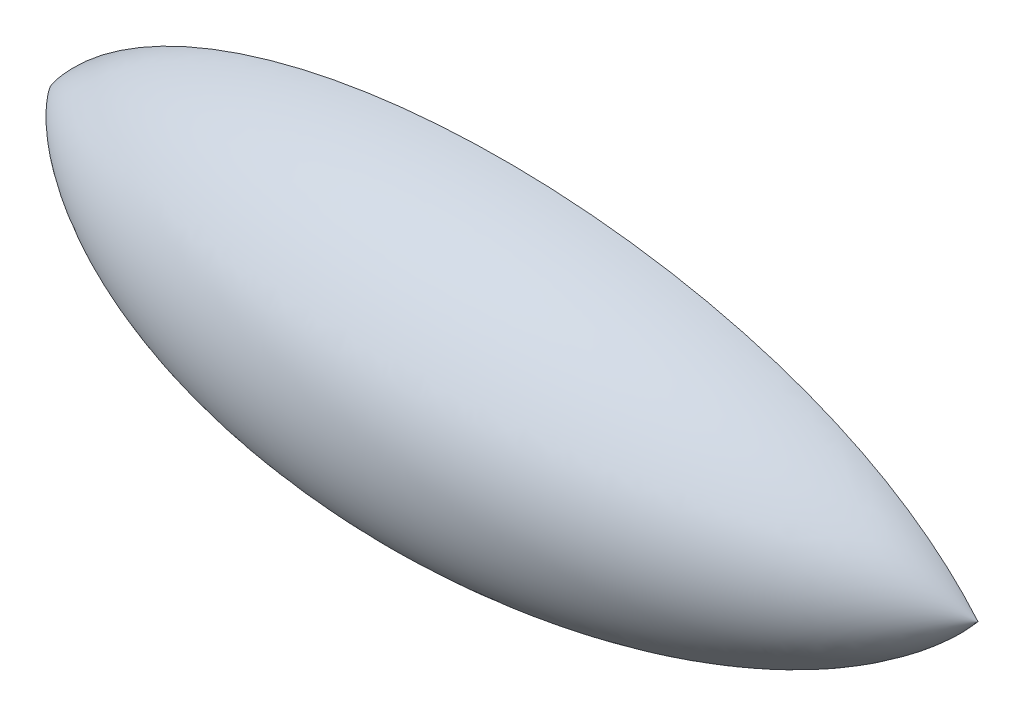
ISO-10303-21;
HEADER;
FILE_DESCRIPTION(('STEP AP214'),'2;1');
FILE_NAME('part.step','',(''),(''),'','','');
FILE_SCHEMA(('AUTOMOTIVE_DESIGN { 1 0 10303 214 1 1 1 1 }'));
ENDSEC;
DATA;
#1=APPLICATION_CONTEXT('core data for automotive mechanical design processes');
#2=APPLICATION_PROTOCOL_DEFINITION('international standard','automotive_design',2000,#1);
#3=PRODUCT_CONTEXT('',#1,'mechanical');
#4=PRODUCT('Part','Part','',(#3));
#5=PRODUCT_RELATED_PRODUCT_CATEGORY('part','',(#4));
#6=PRODUCT_DEFINITION_FORMATION('','',#4);
#7=PRODUCT_DEFINITION_CONTEXT('part definition',#1,'design');
#8=PRODUCT_DEFINITION('design','',#6,#7);
#9=PRODUCT_DEFINITION_SHAPE('','',#8);
#10=(LENGTH_UNIT() NAMED_UNIT(*) SI_UNIT(.MILLI.,.METRE.));
#11=(NAMED_UNIT(*) PLANE_ANGLE_UNIT() SI_UNIT($,.RADIAN.));
#12=(NAMED_UNIT(*) SI_UNIT($,.STERADIAN.) SOLID_ANGLE_UNIT());
#13=UNCERTAINTY_MEASURE_WITH_UNIT(LENGTH_MEASURE(1.E-05),#10,'distance_accuracy_value','');
#14=(GEOMETRIC_REPRESENTATION_CONTEXT(3) GLOBAL_UNCERTAINTY_ASSIGNED_CONTEXT((#13)) GLOBAL_UNIT_ASSIGNED_CONTEXT((#10,
#11,#12)) REPRESENTATION_CONTEXT('',''));
#15=CARTESIAN_POINT('',(0.,0.,0.));
#16=DIRECTION('',(0.,0.,1.));
#17=DIRECTION('',(1.,0.,0.));
#18=AXIS2_PLACEMENT_3D('',#15,#16,#17);
#19=CARTESIAN_POINT('',(2.1813187768371,-20.7802074822245,-1.45107413282951E-13));
#20=DIRECTION('',(0.,0.,-1.));
#21=DIRECTION('',(1.,0.,0.));
#22=AXIS2_PLACEMENT_3D('',#19,#20,#21);
#23=PLANE('',#22);
#24=CARTESIAN_POINT('',(62.4192757679537,0.,0.));
#25=CARTESIAN_POINT('',(48.9957756028024,-15.9404064461172,-1.11311263280386E-13));
#26=CARTESIAN_POINT('',(25.8402378179163,-21.6453940163065,-1.51148978559682E-13));
#27=CARTESIAN_POINT('',(3.18808128922345,-23.6589190410792,-1.65209348658257E-13));
#28=CARTESIAN_POINT('',(-22.1487752724997,-23.6589190410792,-1.65209348658257E-13));
#29=CARTESIAN_POINT('',(-46.6466630739009,-13.5912939172157,0.));
#30=CARTESIAN_POINT('',(-56.0431131895068,0.,0.));
#31=B_SPLINE_CURVE_WITH_KNOTS('',6,(#24,#25,#26,#27,#28,#29,#30),.UNSPECIFIED.,.F.,.F.,(7,7),
(0.,1.),.UNSPECIFIED.);
#32=CARTESIAN_POINT('',(62.4192757679537,0.,0.));
#33=VERTEX_POINT('',#32);
#34=CARTESIAN_POINT('',(-56.0431131895068,0.,0.));
#35=VERTEX_POINT('',#34);
#36=EDGE_CURVE('E11',#33,#35,#31,.T.);
#37=ORIENTED_EDGE('',*,*,#36,.T.);
#38=CARTESIAN_POINT('',(62.4192757679537,0.,0.));
#39=CARTESIAN_POINT('',(48.9957756028024,15.9404064461172,0.));
#40=CARTESIAN_POINT('',(25.8402378179163,21.6453940163065,0.));
#41=CARTESIAN_POINT('',(3.18808128922345,23.6589190410792,0.));
#42=CARTESIAN_POINT('',(-22.1487752724997,23.6589190410792,0.));
#43=CARTESIAN_POINT('',(-46.6466630739009,13.5912939172157,0.));
#44=CARTESIAN_POINT('',(-56.0431131895068,0.,0.));
#45=B_SPLINE_CURVE_WITH_KNOTS('',6,(#38,#39,#40,#41,#42,#43,#44),.UNSPECIFIED.,.F.,.F.,(7,7),
(0.,1.),.UNSPECIFIED.);
#46=EDGE_CURVE('E44',#33,#35,#45,.T.);
#47=ORIENTED_EDGE('',*,*,#46,.F.);
#48=EDGE_LOOP('',(#37,#47));
#49=FACE_BOUND('',#48,.T.);
#50=CARTESIAN_POINT('',(58.3693003401558,-1.00432870813252E-05,0.));
#51=CARTESIAN_POINT('',(58.3690640440386,-0.00025174226842337,0.));
#52=CARTESIAN_POINT('',(58.3688277445528,-0.000493437956407781,0.));
#53=CARTESIAN_POINT('',(58.3678457462283,-0.00149783346897973,0.));
#54=CARTESIAN_POINT('',(58.3671000172138,-0.00226050379065713,0.));
#55=CARTESIAN_POINT('',(58.3633712044022,-0.00607369146133175,0.));
#56=CARTESIAN_POINT('',(58.3603876175187,-0.00912371686443271,0.));
#57=CARTESIAN_POINT('',(58.3454669989555,-0.0243712231224867,0.));
#58=CARTESIAN_POINT('',(58.3335219231302,-0.0365608332229112,0.));
#59=CARTESIAN_POINT('',(58.2737535774685,-0.0974670873434943,0.));
#60=CARTESIAN_POINT('',(58.2258019356835,-0.146057802496224,0.));
#61=CARTESIAN_POINT('',(57.985355145163,-0.388351322381834,0.));
#62=CARTESIAN_POINT('',(57.79082724162,-0.580040216970732,0.));
#63=CARTESIAN_POINT('',(57.2006284956242,-1.1490479061876,0.));
#64=CARTESIAN_POINT('',(56.7987100840395,-1.51992105709936,0.));
#65=CARTESIAN_POINT('',(55.9797563478378,-2.24462112658814,0.));
#66=CARTESIAN_POINT('',(55.5627186815305,-2.59844538467391,0.));
#67=CARTESIAN_POINT('',(54.2831193145933,-3.64124408156335,0.));
#68=CARTESIAN_POINT('',(53.3994337831938,-4.30450195958475,0.));
#69=CARTESIAN_POINT('',(51.5867301658974,-5.56634457975788,0.));
#70=CARTESIAN_POINT('',(50.6576865446639,-6.16489226798589,0.));
#71=CARTESIAN_POINT('',(48.7608173495559,-7.30307328726628,0.));
#72=CARTESIAN_POINT('',(47.792891115286,-7.84253816136003,0.));
#73=CARTESIAN_POINT('',(45.8280651022872,-8.86528471093566,0.));
#74=CARTESIAN_POINT('',(44.8311677870671,-9.3485711460876,0.));
#75=CARTESIAN_POINT('',(42.8213592044628,-10.2602873948288,0.));
#76=CARTESIAN_POINT('',(41.8086149593325,-10.689087189773,0.));
#77=CARTESIAN_POINT('',(39.7641685601869,-11.5001575211637,0.));
#78=CARTESIAN_POINT('',(38.732457331423,-11.8824050807447,0.));
#79=CARTESIAN_POINT('',(36.6535857149557,-12.6039559235338,0.));
#80=CARTESIAN_POINT('',(35.606417568188,-12.9432367588628,0.));
#81=CARTESIAN_POINT('',(33.4999282912269,-13.5818051098708,0.));
#82=CARTESIAN_POINT('',(32.4406063634556,-13.8810899843715,0.));
#83=CARTESIAN_POINT('',(30.3113131500597,-14.4425494886979,-1.00851784050214E-13));
#84=CARTESIAN_POINT('',(29.2413341149181,-14.7046946244989,-1.0268233374965E-13));
#85=CARTESIAN_POINT('',(27.0938209797202,-15.193743498531,-1.0609734378458E-13));
#86=CARTESIAN_POINT('',(26.0162900168142,-15.4206610576291,-1.07681900630674E-13));
#87=CARTESIAN_POINT('',(23.8549520125097,-15.8411737246486,-1.10618324889966E-13));
#88=CARTESIAN_POINT('',(22.7711460446105,-16.0347743677557,-1.11970230955158E-13));
#89=CARTESIAN_POINT('',(20.5984478415627,-16.390137660745,-1.14451719567122E-13));
#90=CARTESIAN_POINT('',(19.5095561232388,-16.5519034766579,-1.15581324222168E-13));
#91=CARTESIAN_POINT('',(17.4703618008956,-16.8255801906008,-1.17492398501382E-13));
#92=CARTESIAN_POINT('',(16.5205597728616,-16.9412444453682,-1.18300077675566E-13));
#93=CARTESIAN_POINT('',(14.6185412931477,-17.149907996689,-1.19757167466632E-13));
#94=CARTESIAN_POINT('',(13.6663250261258,-17.2429089768147,-1.20406589839838E-13));
#95=CARTESIAN_POINT('',(11.7600208845634,-17.4066350148579,-1.2154988265286E-13));
#96=CARTESIAN_POINT('',(10.8059330856859,-17.4773609553753,-1.22043759255837E-13));
#97=CARTESIAN_POINT('',(8.89616717110484,-17.596786593523,-1.22877704029781E-13));
#98=CARTESIAN_POINT('',(7.94048874693294,-17.6454813516438,-1.23217737708337E-13));
#99=CARTESIAN_POINT('',(6.02822736333507,-17.7209158570893,-1.23744494044473E-13));
#100=CARTESIAN_POINT('',(5.07164437091476,-17.7476547700006,-1.23931210875375E-13));
#101=CARTESIAN_POINT('',(3.15802554492292,-17.7791362123503,-1.24151044612342E-13));
#102=CARTESIAN_POINT('',(2.20098967460856,-17.783876454416,-1.2418414554577E-13));
#103=CARTESIAN_POINT('',(-0.140094903761053,-17.7683701233746,-1.2407586541484E-13));
#104=CARTESIAN_POINT('',(-1.52408325584488,-17.7360270548515,-1.23850014974462E-13));
#105=CARTESIAN_POINT('',(-4.29041406096039,-17.6240602982778,-1.23068155292166E-13));
#106=CARTESIAN_POINT('',(-5.672756137767,-17.5444273345002,-1.22512081278193E-13));
#107=CARTESIAN_POINT('',(-8.43414525198406,-17.3364066288555,-1.21059480454491E-13));
#108=CARTESIAN_POINT('',(-9.81319136679521,-17.2080065513709,-1.20162867505604E-13));
#109=CARTESIAN_POINT('',(-12.5662721514626,-16.9004352720007,-1.18015108741033E-13));
#110=CARTESIAN_POINT('',(-13.9403042672941,-16.7212410902887,-1.1676380245808E-13));
#111=CARTESIAN_POINT('',(-16.6780883171631,-16.309964049591,-1.13891870232699E-13));
#112=CARTESIAN_POINT('',(-18.0418537282524,-16.077971349577,-1.12271873867005E-13));
#113=CARTESIAN_POINT('',(-20.7585435578917,-15.5578900281963,-1.08640165410442E-13));
#114=CARTESIAN_POINT('',(-22.1114691939213,-15.2698078012072,-1.06628497971272E-13));
#115=CARTESIAN_POINT('',(-24.8023857281468,-14.633987877359,-1.02188591173311E-13));
#116=CARTESIAN_POINT('',(-26.1403855307741,-14.2862880253647,0.));
#117=CARTESIAN_POINT('',(-28.7972485204271,-13.5267933532981,0.));
#118=CARTESIAN_POINT('',(-30.1161240217968,-13.1150419809145,0.));
#119=CARTESIAN_POINT('',(-32.3676100212506,-12.3455727903091,0.));
#120=CARTESIAN_POINT('',(-33.3059311399125,-12.0045258100798,0.));
#121=CARTESIAN_POINT('',(-35.1675061951951,-11.2833904376375,0.));
#122=CARTESIAN_POINT('',(-36.0907604380203,-10.9033028399961,0.));
#123=CARTESIAN_POINT('',(-37.9178009231575,-10.1015846935436,0.));
#124=CARTESIAN_POINT('',(-38.8216088556949,-9.68000370329954,0.));
#125=CARTESIAN_POINT('',(-40.6065927291332,-8.791421554776,0.));
#126=CARTESIAN_POINT('',(-41.4877728824911,-8.32442892909778,0.));
#127=CARTESIAN_POINT('',(-42.8086591854098,-7.57517487260909,0.));
#128=CARTESIAN_POINT('',(-43.2586389202352,-7.31093045343648,0.));
#129=CARTESIAN_POINT('',(-44.1498513324425,-6.76810498116911,0.));
#130=CARTESIAN_POINT('',(-44.5910846408832,-6.48952496764786,0.));
#131=CARTESIAN_POINT('',(-45.4634705872602,-5.91734739503335,0.));
#132=CARTESIAN_POINT('',(-45.8946271444157,-5.62375582104041,0.));
#133=CARTESIAN_POINT('',(-46.7456564919833,-5.02055523607799,0.));
#134=CARTESIAN_POINT('',(-47.1655284872993,-4.71094510093301,0.));
#135=CARTESIAN_POINT('',(-48.0015526914025,-4.06759227790611,0.));
#136=CARTESIAN_POINT('',(-48.4174086008983,-3.73346332792058,0.));
#137=CARTESIAN_POINT('',(-49.2331802023533,-3.04637233971368,0.));
#138=CARTESIAN_POINT('',(-49.6330984850164,-2.69341338435476,0.));
#139=CARTESIAN_POINT('',(-50.4177543083217,-1.96410405569045,0.));
#140=CARTESIAN_POINT('',(-50.8023265014755,-1.58757456317083,0.));
#141=CARTESIAN_POINT('',(-51.3626738970807,-1.00583245682603,0.));
#142=CARTESIAN_POINT('',(-51.5469658336691,-0.80878857032743,0.));
#143=CARTESIAN_POINT('',(-51.8187725488104,-0.508871013638165,0.));
#144=CARTESIAN_POINT('',(-51.9086409744289,-0.408128472831491,0.));
#145=CARTESIAN_POINT('',(-52.042216380923,-0.255917862354035,0.));
#146=CARTESIAN_POINT('',(-52.0865421356724,-0.204992118444875,0.));
#147=CARTESIAN_POINT('',(-52.1527149987659,-0.128328327525312,0.));
#148=CARTESIAN_POINT('',(-52.1747206638246,-0.102727076124572,0.));
#149=CARTESIAN_POINT('',(-52.2076490706512,-0.0642563197348985,0.));
#150=CARTESIAN_POINT('',(-52.2186119436213,-0.0514211532727919,0.));
#151=CARTESIAN_POINT('',(-52.235036086047,-0.0321511732010189,0.));
#152=CARTESIAN_POINT('',(-52.2405074498599,-0.0257249620052432,0.));
#153=CARTESIAN_POINT('',(-52.2487094356449,-0.0160813365070315,0.));
#154=CARTESIAN_POINT('',(-52.2514425889467,-0.0128660749513775,0.));
#155=CARTESIAN_POINT('',(-52.2555410516429,-0.00804210529862305,0.));
#156=CARTESIAN_POINT('',(-52.2569069948363,-0.00643393565992994,0.));
#157=CARTESIAN_POINT('',(-52.2589555925276,-0.00402141185547979,0.));
#158=CARTESIAN_POINT('',(-52.2596384055962,-0.0032171923377385,0.));
#159=CARTESIAN_POINT('',(-52.2606625458888,-0.00201079572240841,0.));
#160=CARTESIAN_POINT('',(-52.2610039127706,-0.00160865229103043,0.));
#161=CARTESIAN_POINT('',(-52.2616839532667,-0.000807484814179178,0.));
#162=CARTESIAN_POINT('',(-52.2620226270868,-0.000408460943377004,0.));
#163=CARTESIAN_POINT('',(-52.2623612878884,-9.42602374300917E-06,0.));
#164=B_SPLINE_CURVE_WITH_KNOTS('',3,(#50,#51,#52,#53,#54,#55,#56,#57,#58,#59,#60,#61,#62,#63,
#64,#65,#66,#67,#68,#69,#70,#71,#72,#73,#74,#75,#76,#77,#78,#79,#80,#81,#82,#83,#84,#85,#86,#87,
#88,#89,#90,#91,#92,#93,#94,#95,#96,#97,#98,#99,#100,#101,#102,#103,#104,#105,#106,#107,#108,
#109,#110,#111,#112,#113,#114,#115,#116,#117,#118,#119,#120,#121,#122,#123,#124,#125,#126,#127,
#128,#129,#130,#131,#132,#133,#134,#135,#136,#137,#138,#139,#140,#141,#142,#143,#144,#145,#146,
#147,#148,#149,#150,#151,#152,#153,#154,#155,#156,#157,#158,#159,#160,#161,#162,#163),
.UNSPECIFIED.,.F.,.F.,(4,2,2,2,2,2,2,2,2,2,2,2,2,2,2,2,2,2,2,2,2,2,2,2,2,2,2,2,2,2,2,2,2,2,2,2,
2,2,2,2,2,2,2,2,2,2,2,2,2,2,2,2,2,2,2,2,4),(0.,0.00101404549861977,0.00421404550170649,
0.0170140456997163,0.068214058354032,0.273014863770695,1.09226527427156,2.73236492081699,
4.37271968259125,7.68390409843143,10.9969746112401,14.3192580804842,17.6412598666365,
20.9393385757207,24.2390385819124,27.5404554595423,30.8420902423234,34.1463324510627,
37.4492750093685,40.7516682945447,44.0537329846259,46.9239197698,49.7938932741894,
52.6637530478341,55.534255941006,58.4048679201777,61.2757783724749,65.428045028528,
69.5811264044875,73.7352590007549,77.8912739813347,82.0402446847739,86.1887426695302,
90.3346168999676,94.4776910494088,97.4720665946413,100.466381209099,103.457161921968,
106.44738176512,108.012650440907,109.577805767711,111.142341861375,112.706987902818,
114.306841517282,115.906434001583,117.52015954131,118.329428941335,118.734415841579,
118.936957096235,119.038233955811,119.088873181357,119.114192894668,119.126852763958,
119.133182700186,119.136347668499,119.13793015268,119.13950027371),.UNSPECIFIED.);
#165=CARTESIAN_POINT('',(58.3693052495452,-5.02164354499943E-06,0.));
#166=VERTEX_POINT('',#165);
#167=CARTESIAN_POINT('',(-52.2623652878179,-4.71301185827732E-06,0.));
#168=VERTEX_POINT('',#167);
#169=EDGE_CURVE('E60',#166,#168,#164,.T.);
#170=ORIENTED_EDGE('',*,*,#169,.F.);
#171=CARTESIAN_POINT('',(58.3693003401559,1.00432870383908E-05,0.));
#172=CARTESIAN_POINT('',(58.3690640440387,0.000251742268387381,0.));
#173=CARTESIAN_POINT('',(58.3688277445528,0.000493437956379529,0.));
#174=CARTESIAN_POINT('',(58.3678457462284,0.00149783346895686,0.));
#175=CARTESIAN_POINT('',(58.3671000172138,0.00226050379063695,0.));
#176=CARTESIAN_POINT('',(58.3633712044022,0.00607369146132072,0.));
#177=CARTESIAN_POINT('',(58.3603876175188,0.00912371686440426,0.));
#178=CARTESIAN_POINT('',(58.3454669989555,0.0243712231223978,0.));
#179=CARTESIAN_POINT('',(58.3335219231303,0.036560833222843,0.));
#180=CARTESIAN_POINT('',(58.2737535774687,0.097467087343529,0.));
#181=CARTESIAN_POINT('',(58.2258019356836,0.146057802496177,0.));
#182=CARTESIAN_POINT('',(57.9853551451629,0.388351322381509,0.));
#183=CARTESIAN_POINT('',(57.7908272416201,0.580040216970571,0.));
#184=CARTESIAN_POINT('',(57.2006284956245,1.14904790618768,0.));
#185=CARTESIAN_POINT('',(56.7987100840396,1.5199210570993,0.));
#186=CARTESIAN_POINT('',(55.9797563478378,2.24462112658797,0.));
#187=CARTESIAN_POINT('',(55.5627186815305,2.59844538467379,0.));
#188=CARTESIAN_POINT('',(54.2831193145935,3.64124408156331,0.));
#189=CARTESIAN_POINT('',(53.3994337831939,4.30450195958468,0.));
#190=CARTESIAN_POINT('',(51.5867301658974,5.56634457975781,0.));
#191=CARTESIAN_POINT('',(50.6576865446639,6.16489226798585,0.));
#192=CARTESIAN_POINT('',(48.7608173495559,7.30307328726626,0.));
#193=CARTESIAN_POINT('',(47.7928911152861,7.84253816136002,0.));
#194=CARTESIAN_POINT('',(45.8280651022873,8.86528471093563,0.));
#195=CARTESIAN_POINT('',(44.8311677870672,9.34857114608756,0.));
#196=CARTESIAN_POINT('',(42.8213592044629,10.2602873948287,0.));
#197=CARTESIAN_POINT('',(41.8086149593327,10.689087189773,0.));
#198=CARTESIAN_POINT('',(39.7641685601871,11.5001575211636,0.));
#199=CARTESIAN_POINT('',(38.7324573314233,11.8824050807446,0.));
#200=CARTESIAN_POINT('',(36.653585714956,12.6039559235337,0.));
#201=CARTESIAN_POINT('',(35.6064175681883,12.9432367588628,0.));
#202=CARTESIAN_POINT('',(33.4999282912272,13.5818051098707,0.));
#203=CARTESIAN_POINT('',(32.4406063634559,13.8810899843714,0.));
#204=CARTESIAN_POINT('',(30.31131315006,14.4425494886978,1.00841744705009E-13));
#205=CARTESIAN_POINT('',(29.2413341149185,14.7046946244988,1.02601858435145E-13));
#206=CARTESIAN_POINT('',(27.0938209797205,15.1937434985309,1.06177787445903E-13));
#207=CARTESIAN_POINT('',(26.0162900168145,15.420661057629,1.07993580545252E-13));
#208=CARTESIAN_POINT('',(23.85495201251,15.8411737246486,1.1030669680717E-13));
#209=CARTESIAN_POINT('',(22.7711460446108,16.0347743677556,1.10804239178591E-13));
#210=CARTESIAN_POINT('',(20.598447841563,16.3901376607449,1.15617595325049E-13));
#211=CARTESIAN_POINT('',(19.5095561232391,16.5519034766579,1.19933029169104E-13));
#212=CARTESIAN_POINT('',(17.4703618008958,16.8255801906007,1.21354750006536E-13));
#213=CARTESIAN_POINT('',(16.5205597728619,16.9412444453681,1.19330102992285E-13));
#214=CARTESIAN_POINT('',(14.6185412931479,17.1499079966889,1.18727218690091E-13));
#215=CARTESIAN_POINT('',(13.666325026126,17.2429089768147,1.20148725313978E-13));
#216=CARTESIAN_POINT('',(11.7600208845636,17.4066350148579,1.21807736960116E-13));
#217=CARTESIAN_POINT('',(10.805933085686,17.4773609553753,1.22045288899517E-13));
#218=CARTESIAN_POINT('',(8.89616717110494,17.596786593523,1.22876174043317E-13));
#219=CARTESIAN_POINT('',(7.94048874693303,17.6454813516437,1.23469586964378E-13));
#220=CARTESIAN_POINT('',(6.02822736333513,17.7209158570893,1.23492635217556E-13));
#221=CARTESIAN_POINT('',(5.07164437091481,17.7476547700006,1.22922226322473E-13));
#222=CARTESIAN_POINT('',(3.15802554492295,17.7791362123502,1.25160134074851E-13));
#223=CARTESIAN_POINT('',(2.20098967460857,17.783876454416,1.27968802032931E-13));
#224=CARTESIAN_POINT('',(-0.140094903761051,17.7683701233746,1.29253910061001E-13));
#225=CARTESIAN_POINT('',(-1.52408325584487,17.7360270548515,1.25237271911675E-13));
#226=CARTESIAN_POINT('',(-4.29041406096038,17.6240602982778,1.21680626160045E-13));
#227=CARTESIAN_POINT('',(-5.67275613776699,17.5444273345002,1.22141497076007E-13));
#228=CARTESIAN_POINT('',(-8.43414525198404,17.3364066288555,1.21430158458268E-13));
#229=CARTESIAN_POINT('',(-9.81319136679518,17.2080065513709,1.20257535532722E-13));
#230=CARTESIAN_POINT('',(-12.5662721514625,16.9004352720007,1.17920397816485E-13));
#231=CARTESIAN_POINT('',(-13.9403042672941,16.7212410902887,1.16755886940653E-13));
#232=CARTESIAN_POINT('',(-16.6780883171631,16.309964049591,1.13899772333644E-13));
#233=CARTESIAN_POINT('',(-18.0418537282524,16.077971349577,1.12209065349028E-13));
#234=CARTESIAN_POINT('',(-20.7585435578917,15.5578900281963,1.08702966772244E-13));
#235=CARTESIAN_POINT('',(-22.1114691939213,15.2698078012072,1.06887589408137E-13));
#236=CARTESIAN_POINT('',(-24.8023857281468,14.633987877359,1.01929663601122E-13));
#237=CARTESIAN_POINT('',(-26.140385530774,14.2862880253647,0.));
#238=CARTESIAN_POINT('',(-28.7972485204271,13.5267933532981,0.));
#239=CARTESIAN_POINT('',(-30.1161240217968,13.1150419809146,0.));
#240=CARTESIAN_POINT('',(-32.3676100212506,12.3455727903091,0.));
#241=CARTESIAN_POINT('',(-33.3059311399125,12.0045258100799,0.));
#242=CARTESIAN_POINT('',(-35.1675061951951,11.2833904376375,0.));
#243=CARTESIAN_POINT('',(-36.0907604380203,10.9033028399961,0.));
#244=CARTESIAN_POINT('',(-37.9178009231575,10.1015846935436,0.));
#245=CARTESIAN_POINT('',(-38.8216088556949,9.68000370329955,0.));
#246=CARTESIAN_POINT('',(-40.6065927291332,8.791421554776,0.));
#247=CARTESIAN_POINT('',(-41.4877728824911,8.32442892909779,0.));
#248=CARTESIAN_POINT('',(-42.8086591854098,7.5751748726091,0.));
#249=CARTESIAN_POINT('',(-43.2586389202352,7.31093045343649,0.));
#250=CARTESIAN_POINT('',(-44.1498513324425,6.76810498116912,0.));
#251=CARTESIAN_POINT('',(-44.5910846408832,6.48952496764787,0.));
#252=CARTESIAN_POINT('',(-45.4634705872601,5.91734739503336,0.));
#253=CARTESIAN_POINT('',(-45.8946271444157,5.62375582104041,0.));
#254=CARTESIAN_POINT('',(-46.7456564919833,5.020555236078,0.));
#255=CARTESIAN_POINT('',(-47.1655284872993,4.71094510093302,0.));
#256=CARTESIAN_POINT('',(-48.0015526914025,4.06759227790612,0.));
#257=CARTESIAN_POINT('',(-48.4174086008983,3.73346332792059,0.));
#258=CARTESIAN_POINT('',(-49.2331802023532,3.04637233971369,0.));
#259=CARTESIAN_POINT('',(-49.6330984850164,2.69341338435478,0.));
#260=CARTESIAN_POINT('',(-50.4177543083217,1.96410405569048,0.));
#261=CARTESIAN_POINT('',(-50.8023265014755,1.58757456317087,0.));
#262=CARTESIAN_POINT('',(-51.3626738970807,1.00583245682606,0.));
#263=CARTESIAN_POINT('',(-51.546965833669,0.808788570327458,0.));
#264=CARTESIAN_POINT('',(-51.8187725488103,0.508871013638205,0.));
#265=CARTESIAN_POINT('',(-51.9086409744288,0.408128472831538,0.));
#266=CARTESIAN_POINT('',(-52.0422163809229,0.255917862354077,0.));
#267=CARTESIAN_POINT('',(-52.0865421356723,0.204992118444909,0.));
#268=CARTESIAN_POINT('',(-52.1527149987659,0.128328327525333,0.));
#269=CARTESIAN_POINT('',(-52.1747206638245,0.10272707612459,0.));
#270=CARTESIAN_POINT('',(-52.2076490706511,0.0642563197349022,0.));
#271=CARTESIAN_POINT('',(-52.2186119436212,0.051421153272787,0.));
#272=CARTESIAN_POINT('',(-52.235036086047,0.0321511732010391,0.));
#273=CARTESIAN_POINT('',(-52.2405074498599,0.0257249620052808,0.));
#274=CARTESIAN_POINT('',(-52.2487094356449,0.0160813365070563,0.));
#275=CARTESIAN_POINT('',(-52.2514425889467,0.0128660749513962,0.));
#276=CARTESIAN_POINT('',(-52.2555410516429,0.00804210529865233,0.));
#277=CARTESIAN_POINT('',(-52.2569069948363,0.00643393565996245,0.));
#278=CARTESIAN_POINT('',(-52.2589555925276,0.00402141185551307,0.));
#279=CARTESIAN_POINT('',(-52.2596384055962,0.00321719233776751,0.));
#280=CARTESIAN_POINT('',(-52.2606625458888,0.00201079572243506,0.));
#281=CARTESIAN_POINT('',(-52.2610039127706,0.00160865229106047,0.));
#282=CARTESIAN_POINT('',(-52.2616839532667,0.00080748481422157,0.));
#283=CARTESIAN_POINT('',(-52.2620226270867,0.000408460943428406,0.));
#284=CARTESIAN_POINT('',(-52.2623612878883,9.42602379830348E-06,0.));
#285=B_SPLINE_CURVE_WITH_KNOTS('',3,(#171,#172,#173,#174,#175,#176,#177,#178,#179,#180,#181,
#182,#183,#184,#185,#186,#187,#188,#189,#190,#191,#192,#193,#194,#195,#196,#197,#198,#199,#200,
#201,#202,#203,#204,#205,#206,#207,#208,#209,#210,#211,#212,#213,#214,#215,#216,#217,#218,#219,
#220,#221,#222,#223,#224,#225,#226,#227,#228,#229,#230,#231,#232,#233,#234,#235,#236,#237,#238,
#239,#240,#241,#242,#243,#244,#245,#246,#247,#248,#249,#250,#251,#252,#253,#254,#255,#256,#257,
#258,#259,#260,#261,#262,#263,#264,#265,#266,#267,#268,#269,#270,#271,#272,#273,#274,#275,#276,
#277,#278,#279,#280,#281,#282,#283,#284),.UNSPECIFIED.,.F.,.F.,(4,2,2,2,2,2,2,2,2,2,2,2,2,2,2,2,
2,2,2,2,2,2,2,2,2,2,2,2,2,2,2,2,2,2,2,2,2,2,2,2,2,2,2,2,2,2,2,2,2,2,2,2,2,2,2,2,4),(0.,
0.00101404549865561,0.00421404550173325,0.0170140456997221,0.0682140583539771,0.273014863770626,
1.09226527427149,2.73236492081689,4.37271968259117,7.68390409843139,10.9969746112402,
14.3192580804842,17.6412598666364,20.9393385757206,24.2390385819122,27.5404554595421,
30.8420902423231,34.1463324510624,37.4492750093682,40.7516682945445,44.0537329846256,
46.9239197697998,49.7938932741893,52.6637530478341,55.534255941006,58.4048679201777,
61.2757783724749,65.428045028528,69.5811264044876,73.7352590007549,77.8912739813347,
82.0402446847739,86.1887426695302,90.3346168999676,94.4776910494088,97.4720665946413,
100.466381209099,103.457161921968,106.44738176512,108.012650440907,109.577805767711,
111.142341861375,112.706987902818,114.306841517282,115.906434001583,117.52015954131,
118.329428941335,118.734415841579,118.936957096235,119.038233955811,119.088873181357,
119.114192894668,119.126852763958,119.133182700186,119.136347668499,119.13793015268,
119.13950027371),.UNSPECIFIED.);
#286=EDGE_CURVE('E50',#166,#168,#285,.T.);
#287=ORIENTED_EDGE('',*,*,#286,.T.);
#288=EDGE_LOOP('',(#170,#287));
#289=FACE_BOUND('',#288,.T.);
#290=ADVANCED_FACE('F33',(#49,#289),#23,.T.);
#291=CARTESIAN_POINT('',(-56.0431131895068,0.,0.));
#292=DIRECTION('',(-1.,0.,0.));
#293=AXIS1_PLACEMENT('',#291,#292);
#294=SURFACE_OF_REVOLUTION('',#31,#293);
#295=ORIENTED_EDGE('',*,*,#46,.T.);
#296=ORIENTED_EDGE('',*,*,#36,.F.);
#297=EDGE_LOOP('',(#295,#296));
#298=FACE_BOUND('',#297,.T.);
#299=ADVANCED_FACE('F35',(#298),#294,.T.);
#300=CARTESIAN_POINT('',(60.5144719452679,-2.09720788441562,0.));
#301=CARTESIAN_POINT('',(46.7154814355829,-16.2117204948818,-1.13205839156841E-13));
#302=CARTESIAN_POINT('',(24.8855457648302,-21.5561125860258,-1.50525529664221E-13));
#303=CARTESIAN_POINT('',(3.11918135553204,-23.5016244751485,-1.6411096657496E-13));
#304=CARTESIAN_POINT('',(-20.8150830979717,-23.2347792859188,-1.62247596577849E-13));
#305=CARTESIAN_POINT('',(-43.9306138805089,-14.4533609131438,-1.00927279823613E-13));
#306=CARTESIAN_POINT('',(-54.5496552820784,-1.94121682975843,0.));
#307=B_SPLINE_CURVE_WITH_KNOTS('',6,(#300,#301,#302,#303,#304,#305,#306),.UNSPECIFIED.,.F.,.F.,
(7,7),(0.0227419322969977,0.975793703792855),.UNSPECIFIED.);
#308=CARTESIAN_POINT('',(-56.0431131895068,0.,0.));
#309=DIRECTION('',(-1.,0.,0.));
#310=AXIS1_PLACEMENT('',#308,#309);
#311=SURFACE_OF_REVOLUTION('',#307,#310);
#312=OFFSET_SURFACE('',#311,-3.,.F.);
#313=ORIENTED_EDGE('',*,*,#286,.F.);
#314=ORIENTED_EDGE('',*,*,#169,.T.);
#315=EDGE_LOOP('',(#313,#314));
#316=FACE_BOUND('',#315,.T.);
#317=ADVANCED_FACE('F61',(#316),#312,.F.);
#318=CLOSED_SHELL('',(#290,#299,#317));
#319=MANIFOLD_SOLID_BREP('B2',#318);
#320=ADVANCED_BREP_SHAPE_REPRESENTATION('',(#18,#319),#14);
#321=SHAPE_DEFINITION_REPRESENTATION(#9,#320);
ENDSEC;
END-ISO-10303-21;
